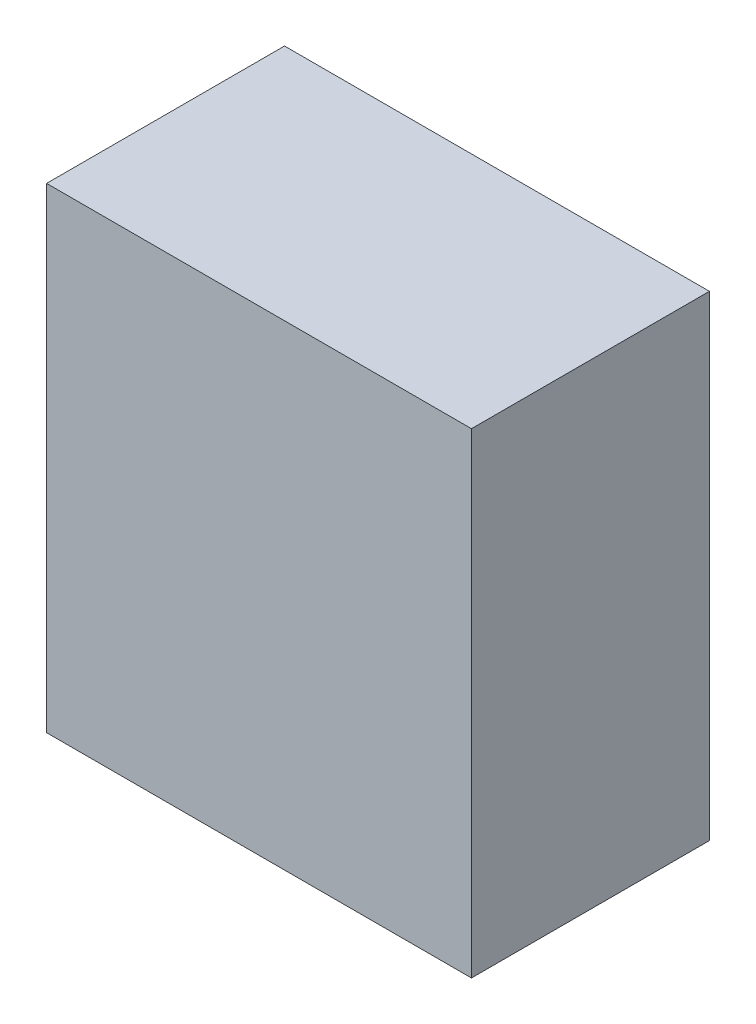
ISO-10303-21;
HEADER;
FILE_DESCRIPTION(('STEP AP214'),'2;1');
FILE_NAME('part.step','',(''),(''),'','','');
FILE_SCHEMA(('AUTOMOTIVE_DESIGN { 1 0 10303 214 1 1 1 1 }'));
ENDSEC;
DATA;
#1=APPLICATION_CONTEXT('core data for automotive mechanical design processes');
#2=APPLICATION_PROTOCOL_DEFINITION('international standard','automotive_design',2000,#1);
#3=PRODUCT_CONTEXT('',#1,'mechanical');
#4=PRODUCT('Part','Part','',(#3));
#5=PRODUCT_RELATED_PRODUCT_CATEGORY('part','',(#4));
#6=PRODUCT_DEFINITION_FORMATION('','',#4);
#7=PRODUCT_DEFINITION_CONTEXT('part definition',#1,'design');
#8=PRODUCT_DEFINITION('design','',#6,#7);
#9=PRODUCT_DEFINITION_SHAPE('','',#8);
#10=(LENGTH_UNIT() NAMED_UNIT(*) SI_UNIT(.MILLI.,.METRE.));
#11=(NAMED_UNIT(*) PLANE_ANGLE_UNIT() SI_UNIT($,.RADIAN.));
#12=(NAMED_UNIT(*) SI_UNIT($,.STERADIAN.) SOLID_ANGLE_UNIT());
#13=UNCERTAINTY_MEASURE_WITH_UNIT(LENGTH_MEASURE(1.E-05),#10,'distance_accuracy_value','');
#14=(GEOMETRIC_REPRESENTATION_CONTEXT(3) GLOBAL_UNCERTAINTY_ASSIGNED_CONTEXT((#13)) GLOBAL_UNIT_ASSIGNED_CONTEXT((#10,
#11,#12)) REPRESENTATION_CONTEXT('',''));
#15=CARTESIAN_POINT('',(0.,0.,0.));
#16=DIRECTION('',(0.,0.,1.));
#17=DIRECTION('',(1.,0.,0.));
#18=AXIS2_PLACEMENT_3D('',#15,#16,#17);
#19=CARTESIAN_POINT('',(0.,0.,0.70000114));
#20=DIRECTION('',(0.,0.,1.));
#21=DIRECTION('',(1.,0.,0.));
#22=AXIS2_PLACEMENT_3D('',#19,#20,#21);
#23=PLANE('',#22);
#24=DIRECTION('',(-1.,0.,0.));
#25=VECTOR('',#24,1.);
#26=CARTESIAN_POINT('',(0.62495938,0.6997573,0.70000114));
#27=LINE('',#26,#25);
#28=CARTESIAN_POINT('',(0.62495938,0.6997573,0.70000114));
#29=VERTEX_POINT('',#28);
#30=CARTESIAN_POINT('',(-0.62495938,0.6997573,0.70000114));
#31=VERTEX_POINT('',#30);
#32=EDGE_CURVE('E85',#29,#31,#27,.T.);
#33=ORIENTED_EDGE('',*,*,#32,.T.);
#34=DIRECTION('',(0.,-1.,0.));
#35=VECTOR('',#34,1.);
#36=CARTESIAN_POINT('',(-0.62495938,0.6997573,0.70000114));
#37=LINE('',#36,#35);
#38=CARTESIAN_POINT('',(-0.62495938,-0.6997573,0.70000114));
#39=VERTEX_POINT('',#38);
#40=EDGE_CURVE('E98',#31,#39,#37,.T.);
#41=ORIENTED_EDGE('',*,*,#40,.T.);
#42=DIRECTION('',(1.,0.,0.));
#43=VECTOR('',#42,1.);
#44=CARTESIAN_POINT('',(-0.62495938,-0.6997573,0.70000114));
#45=LINE('',#44,#43);
#46=CARTESIAN_POINT('',(0.62495938,-0.6997573,0.70000114));
#47=VERTEX_POINT('',#46);
#48=EDGE_CURVE('E77',#39,#47,#45,.T.);
#49=ORIENTED_EDGE('',*,*,#48,.T.);
#50=DIRECTION('',(0.,1.,0.));
#51=VECTOR('',#50,1.);
#52=CARTESIAN_POINT('',(0.62495938,-0.6997573,0.70000114));
#53=LINE('',#52,#51);
#54=EDGE_CURVE('E11',#47,#29,#53,.T.);
#55=ORIENTED_EDGE('',*,*,#54,.T.);
#56=EDGE_LOOP('',(#33,#41,#49,#55));
#57=FACE_BOUND('',#56,.T.);
#58=ADVANCED_FACE('F16',(#57),#23,.T.);
#59=CARTESIAN_POINT('',(0.,0.,0.));
#60=DIRECTION('',(0.,0.,1.));
#61=DIRECTION('',(1.,0.,0.));
#62=AXIS2_PLACEMENT_3D('',#59,#60,#61);
#63=PLANE('',#62);
#64=DIRECTION('',(0.,1.,0.));
#65=VECTOR('',#64,1.);
#66=CARTESIAN_POINT('',(0.62495938,-0.6997573,0.));
#67=LINE('',#66,#65);
#68=CARTESIAN_POINT('',(0.62495938,-0.6997573,0.));
#69=VERTEX_POINT('',#68);
#70=CARTESIAN_POINT('',(0.62495938,0.6997573,0.));
#71=VERTEX_POINT('',#70);
#72=EDGE_CURVE('E27',#69,#71,#67,.T.);
#73=ORIENTED_EDGE('',*,*,#72,.F.);
#74=DIRECTION('',(1.,0.,0.));
#75=VECTOR('',#74,1.);
#76=CARTESIAN_POINT('',(-0.62495938,-0.6997573,0.));
#77=LINE('',#76,#75);
#78=CARTESIAN_POINT('',(-0.62495938,-0.6997573,0.));
#79=VERTEX_POINT('',#78);
#80=EDGE_CURVE('E102',#79,#69,#77,.T.);
#81=ORIENTED_EDGE('',*,*,#80,.F.);
#82=DIRECTION('',(0.,-1.,0.));
#83=VECTOR('',#82,1.);
#84=CARTESIAN_POINT('',(-0.62495938,0.6997573,0.));
#85=LINE('',#84,#83);
#86=CARTESIAN_POINT('',(-0.62495938,0.6997573,0.));
#87=VERTEX_POINT('',#86);
#88=EDGE_CURVE('E61',#87,#79,#85,.T.);
#89=ORIENTED_EDGE('',*,*,#88,.F.);
#90=DIRECTION('',(-1.,0.,0.));
#91=VECTOR('',#90,1.);
#92=CARTESIAN_POINT('',(0.62495938,0.6997573,0.));
#93=LINE('',#92,#91);
#94=EDGE_CURVE('E83',#71,#87,#93,.T.);
#95=ORIENTED_EDGE('',*,*,#94,.F.);
#96=EDGE_LOOP('',(#73,#81,#89,#95));
#97=FACE_BOUND('',#96,.T.);
#98=ADVANCED_FACE('F18',(#97),#63,.F.);
#99=CARTESIAN_POINT('',(0.62495938,-0.6997573,0.));
#100=DIRECTION('',(-1.,0.,0.));
#101=DIRECTION('',(0.,0.,1.));
#102=AXIS2_PLACEMENT_3D('',#99,#100,#101);
#103=PLANE('',#102);
#104=ORIENTED_EDGE('',*,*,#72,.T.);
#105=DIRECTION('',(0.,0.,1.));
#106=VECTOR('',#105,1.);
#107=CARTESIAN_POINT('',(0.62495938,0.6997573,0.));
#108=LINE('',#107,#106);
#109=EDGE_CURVE('E71',#71,#29,#108,.T.);
#110=ORIENTED_EDGE('',*,*,#109,.T.);
#111=ORIENTED_EDGE('',*,*,#54,.F.);
#112=DIRECTION('',(0.,0.,1.));
#113=VECTOR('',#112,1.);
#114=CARTESIAN_POINT('',(0.62495938,-0.6997573,0.));
#115=LINE('',#114,#113);
#116=EDGE_CURVE('E74',#69,#47,#115,.T.);
#117=ORIENTED_EDGE('',*,*,#116,.F.);
#118=EDGE_LOOP('',(#104,#110,#111,#117));
#119=FACE_BOUND('',#118,.T.);
#120=ADVANCED_FACE('F70',(#119),#103,.F.);
#121=CARTESIAN_POINT('',(-0.62495938,-0.6997573,0.));
#122=DIRECTION('',(0.,1.,0.));
#123=DIRECTION('',(1.,0.,0.));
#124=AXIS2_PLACEMENT_3D('',#121,#122,#123);
#125=PLANE('',#124);
#126=ORIENTED_EDGE('',*,*,#80,.T.);
#127=ORIENTED_EDGE('',*,*,#116,.T.);
#128=ORIENTED_EDGE('',*,*,#48,.F.);
#129=DIRECTION('',(0.,0.,1.));
#130=VECTOR('',#129,1.);
#131=CARTESIAN_POINT('',(-0.62495938,-0.6997573,0.));
#132=LINE('',#131,#130);
#133=EDGE_CURVE('E20',#79,#39,#132,.T.);
#134=ORIENTED_EDGE('',*,*,#133,.F.);
#135=EDGE_LOOP('',(#126,#127,#128,#134));
#136=FACE_BOUND('',#135,.T.);
#137=ADVANCED_FACE('F159',(#136),#125,.F.);
#138=CARTESIAN_POINT('',(-0.62495938,0.6997573,0.));
#139=DIRECTION('',(1.,0.,0.));
#140=DIRECTION('',(0.,1.,0.));
#141=AXIS2_PLACEMENT_3D('',#138,#139,#140);
#142=PLANE('',#141);
#143=ORIENTED_EDGE('',*,*,#88,.T.);
#144=ORIENTED_EDGE('',*,*,#133,.T.);
#145=ORIENTED_EDGE('',*,*,#40,.F.);
#146=DIRECTION('',(0.,0.,1.));
#147=VECTOR('',#146,1.);
#148=CARTESIAN_POINT('',(-0.62495938,0.6997573,0.));
#149=LINE('',#148,#147);
#150=EDGE_CURVE('E89',#87,#31,#149,.T.);
#151=ORIENTED_EDGE('',*,*,#150,.F.);
#152=EDGE_LOOP('',(#143,#144,#145,#151));
#153=FACE_BOUND('',#152,.T.);
#154=ADVANCED_FACE('F114',(#153),#142,.F.);
#155=CARTESIAN_POINT('',(0.62495938,0.6997573,0.));
#156=DIRECTION('',(0.,-1.,0.));
#157=DIRECTION('',(0.,0.,-1.));
#158=AXIS2_PLACEMENT_3D('',#155,#156,#157);
#159=PLANE('',#158);
#160=ORIENTED_EDGE('',*,*,#94,.T.);
#161=ORIENTED_EDGE('',*,*,#150,.T.);
#162=ORIENTED_EDGE('',*,*,#32,.F.);
#163=ORIENTED_EDGE('',*,*,#109,.F.);
#164=EDGE_LOOP('',(#160,#161,#162,#163));
#165=FACE_BOUND('',#164,.T.);
#166=ADVANCED_FACE('F81',(#165),#159,.F.);
#167=CLOSED_SHELL('',(#58,#98,#120,#137,#154,#166));
#168=MANIFOLD_SOLID_BREP('B1',#167);
#169=ADVANCED_BREP_SHAPE_REPRESENTATION('',(#18,#168),#14);
#170=SHAPE_DEFINITION_REPRESENTATION(#9,#169);
ENDSEC;
END-ISO-10303-21;
